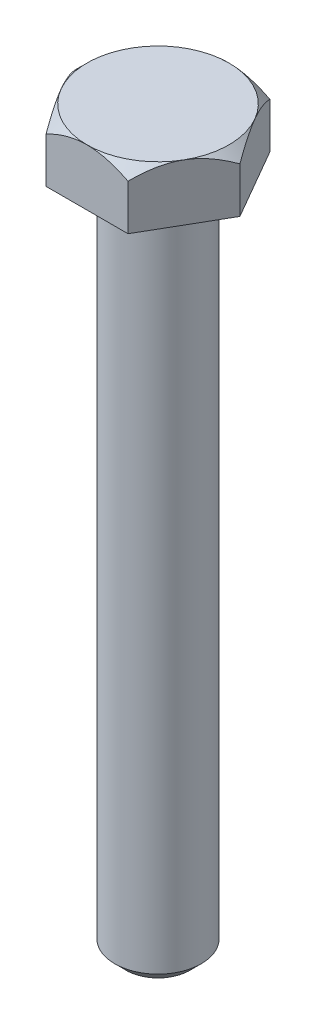
ISO-10303-21;
HEADER;
FILE_DESCRIPTION(('STEP AP214'),'2;1');
FILE_NAME('part.step','',(''),(''),'','','');
FILE_SCHEMA(('AUTOMOTIVE_DESIGN { 1 0 10303 214 1 1 1 1 }'));
ENDSEC;
DATA;
#1=APPLICATION_CONTEXT('core data for automotive mechanical design processes');
#2=APPLICATION_PROTOCOL_DEFINITION('international standard','automotive_design',2000,#1);
#3=PRODUCT_CONTEXT('',#1,'mechanical');
#4=PRODUCT('Part','Part','',(#3));
#5=PRODUCT_RELATED_PRODUCT_CATEGORY('part','',(#4));
#6=PRODUCT_DEFINITION_FORMATION('','',#4);
#7=PRODUCT_DEFINITION_CONTEXT('part definition',#1,'design');
#8=PRODUCT_DEFINITION('design','',#6,#7);
#9=PRODUCT_DEFINITION_SHAPE('','',#8);
#10=(LENGTH_UNIT() NAMED_UNIT(*) SI_UNIT(.MILLI.,.METRE.));
#11=(NAMED_UNIT(*) PLANE_ANGLE_UNIT() SI_UNIT($,.RADIAN.));
#12=(NAMED_UNIT(*) SI_UNIT($,.STERADIAN.) SOLID_ANGLE_UNIT());
#13=UNCERTAINTY_MEASURE_WITH_UNIT(LENGTH_MEASURE(1.E-05),#10,'distance_accuracy_value','');
#14=(GEOMETRIC_REPRESENTATION_CONTEXT(3) GLOBAL_UNCERTAINTY_ASSIGNED_CONTEXT((#13)) GLOBAL_UNIT_ASSIGNED_CONTEXT((#10,
#11,#12)) REPRESENTATION_CONTEXT('',''));
#15=CARTESIAN_POINT('',(0.,0.,0.));
#16=DIRECTION('',(0.,0.,1.));
#17=DIRECTION('',(1.,0.,0.));
#18=AXIS2_PLACEMENT_3D('',#15,#16,#17);
#19=CARTESIAN_POINT('',(3.62500000000007,5.,6.27868417743714));
#20=DIRECTION('',(-0.866025403784442,0.,-0.499999999999995));
#21=DIRECTION('',(-0.499999999999995,0.,0.866025403784442));
#22=AXIS2_PLACEMENT_3D('',#19,#20,#21);
#23=PLANE('',#22);
#24=CARTESIAN_POINT('',(3.62488452994624,4.02856870462476,6.27888417743714));
#25=CARTESIAN_POINT('',(3.68721389664161,4.0908916934917,6.17092654751716));
#26=CARTESIAN_POINT('',(3.75002235616352,4.15130208102734,6.06213910448007));
#27=CARTESIAN_POINT('',(3.87669145105401,4.2677158493395,5.84274179638098));
#28=CARTESIAN_POINT('',(3.94055263837515,4.32371682320785,5.73213097530909));
#29=CARTESIAN_POINT('',(4.13444955410337,4.48471046563524,5.39629166583691));
#30=CARTESIAN_POINT('',(4.26612670995196,4.58200705628878,5.16822014171098));
#31=CARTESIAN_POINT('',(4.53166422082633,4.74862075095615,4.70829568156119));
#32=CARTESIAN_POINT('',(4.66545670737727,4.81835760873348,4.47656029718399));
#33=CARTESIAN_POINT('',(4.86834501872006,4.89902600771869,4.12514743367641));
#34=CARTESIAN_POINT('',(4.93627316062514,4.92191520494596,4.00749244063306));
#35=CARTESIAN_POINT('',(5.07270459498125,4.95919667933445,3.77118626457879));
#36=CARTESIAN_POINT('',(5.14120779992591,4.97359022631844,3.65253523313333));
#37=CARTESIAN_POINT('',(5.30814078917526,4.99772308228725,3.3633988142941));
#38=CARTESIAN_POINT('',(5.40675043702598,5.0027866000747,3.19260189410018));
#39=CARTESIAN_POINT('',(5.60379200256286,4.99428769024785,2.85131589138739));
#40=CARTESIAN_POINT('',(5.70222384583931,4.98071873353769,2.68082693774991));
#41=CARTESIAN_POINT('',(5.89815953180448,4.9357547130673,2.34145637464237));
#42=CARTESIAN_POINT('',(5.99566221252046,4.9043397144273,2.17257677776813));
#43=CARTESIAN_POINT('',(6.18899174051392,4.82539152715257,1.83772021268014));
#44=CARTESIAN_POINT('',(6.28481871570106,4.77785957445157,1.67174302292037));
#45=CARTESIAN_POINT('',(6.45492849942725,4.68007191376467,1.37710423464204));
#46=CARTESIAN_POINT('',(6.52958798795453,4.63238802285783,1.2477902072457));
#47=CARTESIAN_POINT('',(6.67756674436656,4.52933616008443,0.991483482699198));
#48=CARTESIAN_POINT('',(6.75088597153632,4.47396795521828,0.864490856069481));
#49=CARTESIAN_POINT('',(6.89595327454856,4.35678861091045,0.613226916735296));
#50=CARTESIAN_POINT('',(6.96770547617939,4.29499773307909,0.488948457955774));
#51=CARTESIAN_POINT('',(7.10988123305974,4.16578428211806,0.24269282343444));
#52=CARTESIAN_POINT('',(7.18030557110013,4.09836516278837,0.120714291859081));
#53=CARTESIAN_POINT('',(7.25011547005384,4.02856870462477,-0.000200000000000499));
#54=B_SPLINE_CURVE_WITH_KNOTS('',3,(#24,#25,#26,#27,#28,#29,#30,#31,#32,#33,#34,#35,#36,#37,#38,
#39,#40,#41,#42,#43,#44,#45,#46,#47,#48,#49,#50,#51,#52,#53),.UNSPECIFIED.,.F.,.F.,(4,2,2,2,2,2,
2,2,2,2,2,2,2,2,4),(0.,0.418085081925561,0.83639681869771,1.67753646991016,2.50531966073267,
2.91839943514191,3.33141745194524,3.9223507147329,4.51349110216463,5.10529312372582,
5.69704977302065,6.16707290687592,6.63711029563191,7.10570744431351,7.57401912040438),.UNSPECIFIED.);
#55=CARTESIAN_POINT('',(3.62500000000007,4.02868417743718,6.27868417743714));
#56=VERTEX_POINT('',#55);
#57=CARTESIAN_POINT('',(5.43750000000002,5.,3.13934208871856));
#58=VERTEX_POINT('',#57);
#59=EDGE_CURVE('E110',#56,#58,#54,.T.);
#60=ORIENTED_EDGE('',*,*,#59,.F.);
#61=DIRECTION('',(0.,-1.,0.));
#62=VECTOR('',#61,1.);
#63=CARTESIAN_POINT('',(3.62500000000007,5.,6.27868417743714));
#64=LINE('',#63,#62);
#65=CARTESIAN_POINT('',(3.62500000000007,0.,6.27868417743714));
#66=VERTEX_POINT('',#65);
#67=EDGE_CURVE('E59',#56,#66,#64,.T.);
#68=ORIENTED_EDGE('',*,*,#67,.T.);
#69=DIRECTION('',(0.499999999999995,0.,-0.866025403784442));
#70=VECTOR('',#69,1.);
#71=CARTESIAN_POINT('',(3.62500000000007,0.,6.27868417743714));
#72=LINE('',#71,#70);
#73=CARTESIAN_POINT('',(7.25,0.,0.));
#74=VERTEX_POINT('',#73);
#75=EDGE_CURVE('E117',#66,#74,#72,.T.);
#76=ORIENTED_EDGE('',*,*,#75,.T.);
#77=DIRECTION('',(0.,-1.,0.));
#78=VECTOR('',#77,1.);
#79=CARTESIAN_POINT('',(7.25,5.,0.));
#80=LINE('',#79,#78);
#81=CARTESIAN_POINT('',(7.25,4.02868417743718,0.));
#82=VERTEX_POINT('',#81);
#83=EDGE_CURVE('E135',#82,#74,#80,.T.);
#84=ORIENTED_EDGE('',*,*,#83,.F.);
#85=EDGE_CURVE('E118',#58,#82,#54,.T.);
#86=ORIENTED_EDGE('',*,*,#85,.F.);
#87=EDGE_LOOP('',(#60,#68,#76,#84,#86));
#88=FACE_BOUND('',#87,.T.);
#89=ADVANCED_FACE('F36',(#88),#23,.F.);
#90=CARTESIAN_POINT('',(7.25,5.,0.));
#91=DIRECTION('',(-0.866025403784438,0.,0.500000000000001));
#92=DIRECTION('',(0.500000000000001,0.,0.866025403784438));
#93=AXIS2_PLACEMENT_3D('',#90,#91,#92);
#94=PLANE('',#93);
#95=CARTESIAN_POINT('',(7.25011547005384,4.02856870462477,0.000200000000000034));
#96=CARTESIAN_POINT('',(7.18778610335847,4.0908916934917,-0.107757629919975));
#97=CARTESIAN_POINT('',(7.12497764383655,4.15130208102734,-0.21654507295707));
#98=CARTESIAN_POINT('',(6.99830854894606,4.2677158493395,-0.435942381056166));
#99=CARTESIAN_POINT('',(6.93444736162492,4.32371682320785,-0.546553202128054));
#100=CARTESIAN_POINT('',(6.7405504458967,4.48471046563526,-0.882392511600232));
#101=CARTESIAN_POINT('',(6.6088732900481,4.58200705628879,-1.11046403572617));
#102=CARTESIAN_POINT('',(6.34333577917372,4.74862075095617,-1.57038849587596));
#103=CARTESIAN_POINT('',(6.20954329262278,4.8183576087335,-1.80212388025316));
#104=CARTESIAN_POINT('',(6.00665498127998,4.89902600771871,-2.15353674376074));
#105=CARTESIAN_POINT('',(5.9387268393749,4.92191520494598,-2.27119173680409));
#106=CARTESIAN_POINT('',(5.80229540501879,4.95919667933447,-2.50749791285837));
#107=CARTESIAN_POINT('',(5.73379220007413,4.97359022631846,-2.62614894430383));
#108=CARTESIAN_POINT('',(5.56685921082478,4.99772308228727,-2.91528536314305));
#109=CARTESIAN_POINT('',(5.46824956297406,5.00278660007473,-3.08608228333698));
#110=CARTESIAN_POINT('',(5.27120799743718,4.99428769024788,-3.42736828604976));
#111=CARTESIAN_POINT('',(5.17277615416072,4.98071873353772,-3.59785723968724));
#112=CARTESIAN_POINT('',(4.97684046819555,4.93575471306732,-3.93722780279478));
#113=CARTESIAN_POINT('',(4.87933778747957,4.90433971442733,-4.10610739966901));
#114=CARTESIAN_POINT('',(4.68600825948611,4.8253915271526,-4.44096396475701));
#115=CARTESIAN_POINT('',(4.59018128429897,4.7778595744516,-4.60694115451677));
#116=CARTESIAN_POINT('',(4.42007150057277,4.68007191376469,-4.9015799427951));
#117=CARTESIAN_POINT('',(4.34541201204549,4.63238802285786,-5.03089397019145));
#118=CARTESIAN_POINT('',(4.19743325563346,4.52933616008445,-5.28720069473796));
#119=CARTESIAN_POINT('',(4.12411402846369,4.4739679552183,-5.41419332136768));
#120=CARTESIAN_POINT('',(3.97904672545145,4.35678861091046,-5.66545726070187));
#121=CARTESIAN_POINT('',(3.90729452382061,4.2949977330791,-5.7897357194814));
#122=CARTESIAN_POINT('',(3.76511876694025,4.16578428211807,-6.03599135400274));
#123=CARTESIAN_POINT('',(3.69469442889986,4.09836516278837,-6.1579698855781));
#124=CARTESIAN_POINT('',(3.62488452994615,4.02856870462476,-6.27888417743719));
#125=B_SPLINE_CURVE_WITH_KNOTS('',3,(#95,#96,#97,#98,#99,#100,#101,#102,#103,#104,#105,#106,
#107,#108,#109,#110,#111,#112,#113,#114,#115,#116,#117,#118,#119,#120,#121,#122,#123,#124),
.UNSPECIFIED.,.F.,.F.,(4,2,2,2,2,2,2,2,2,2,2,2,2,2,4),(0.,0.418085081925567,0.83639681869772,
1.67753646991019,2.5053196607327,2.91839943514195,3.33141745194528,3.92235071473293,
4.51349110216466,5.10529312372585,5.69704977302068,6.16707290687597,6.63711029563198,
7.1057074443136,7.57401912040448),.UNSPECIFIED.);
#126=CARTESIAN_POINT('',(5.43749999999999,5.,-3.13934208871859));
#127=VERTEX_POINT('',#126);
#128=EDGE_CURVE('E125',#82,#127,#125,.T.);
#129=ORIENTED_EDGE('',*,*,#128,.F.);
#130=ORIENTED_EDGE('',*,*,#83,.T.);
#131=DIRECTION('',(-0.500000000000001,0.,-0.866025403784438));
#132=VECTOR('',#131,1.);
#133=CARTESIAN_POINT('',(7.25,0.,0.));
#134=LINE('',#133,#132);
#135=CARTESIAN_POINT('',(3.62499999999999,0.,-6.27868417743719));
#136=VERTEX_POINT('',#135);
#137=EDGE_CURVE('E398',#74,#136,#134,.T.);
#138=ORIENTED_EDGE('',*,*,#137,.T.);
#139=DIRECTION('',(0.,-1.,0.));
#140=VECTOR('',#139,1.);
#141=CARTESIAN_POINT('',(3.62499999999999,5.,-6.27868417743719));
#142=LINE('',#141,#140);
#143=CARTESIAN_POINT('',(3.62499999999999,4.02868417743718,-6.27868417743719));
#144=VERTEX_POINT('',#143);
#145=EDGE_CURVE('E204',#144,#136,#142,.T.);
#146=ORIENTED_EDGE('',*,*,#145,.F.);
#147=EDGE_CURVE('E136',#127,#144,#125,.T.);
#148=ORIENTED_EDGE('',*,*,#147,.F.);
#149=EDGE_LOOP('',(#129,#130,#138,#146,#148));
#150=FACE_BOUND('',#149,.T.);
#151=ADVANCED_FACE('F192',(#150),#94,.F.);
#152=CARTESIAN_POINT('',(3.62499999999999,5.,-6.27868417743719));
#153=DIRECTION('',(0.,0.,1.));
#154=DIRECTION('',(1.,0.,0.));
#155=AXIS2_PLACEMENT_3D('',#152,#153,#154);
#156=PLANE('',#155);
#157=CARTESIAN_POINT('',(-7.57666051860033,1.43857952280487,-6.27868417743715));
#158=CARTESIAN_POINT('',(-7.39365651230783,1.57945688959872,-6.27868417743715));
#159=CARTESIAN_POINT('',(-7.20966776392706,1.71907512434262,-6.27868417743715));
#160=CARTESIAN_POINT('',(-6.83931781583867,1.99521769306877,-6.27868417743715));
#161=CARTESIAN_POINT('',(-6.65295606622731,2.13174128876494,-6.27868417743715));
#162=CARTESIAN_POINT('',(-6.27609540777261,2.40209046760801,-6.27868417743715));
#163=CARTESIAN_POINT('',(-6.08557567548029,2.53588711812094,-6.27868417743715));
#164=CARTESIAN_POINT('',(-5.7013676758548,2.79883528544532,-6.27868417743716));
#165=CARTESIAN_POINT('',(-5.50767962786199,2.92798712185071,-6.27868417743716));
#166=CARTESIAN_POINT('',(-5.10415932230891,3.18862292545138,-6.27868417743716));
#167=CARTESIAN_POINT('',(-4.89408397797518,3.31973242959604,-6.27868417743716));
#168=CARTESIAN_POINT('',(-4.46899924146733,3.57382963916996,-6.27868417743716));
#169=CARTESIAN_POINT('',(-4.25398902548427,3.69681597506302,-6.27868417743716));
#170=CARTESIAN_POINT('',(-3.81897305439861,3.93204888921299,-6.27868417743716));
#171=CARTESIAN_POINT('',(-3.59898447967616,4.04432699068524,-6.27868417743716));
#172=CARTESIAN_POINT('',(-3.15278127156474,4.25562782816849,-6.27868417743717));
#173=CARTESIAN_POINT('',(-2.92656964053751,4.35465682564157,-6.27868417743717));
#174=CARTESIAN_POINT('',(-2.49021164331831,4.52687246842811,-6.27868417743717));
#175=CARTESIAN_POINT('',(-2.28069897147736,4.60164844585029,-6.27868417743717));
#176=CARTESIAN_POINT('',(-1.85632597962451,4.73443118921241,-6.27868417743717));
#177=CARTESIAN_POINT('',(-1.64146532079161,4.79243688972169,-6.27868417743717));
#178=CARTESIAN_POINT('',(-1.21142765694939,4.8875683886695,-6.27868417743717));
#179=CARTESIAN_POINT('',(-0.996336148218653,4.9250741683904,-6.27868417743717));
#180=CARTESIAN_POINT('',(-0.56346815275014,4.97842167925469,-6.27868417743717));
#181=CARTESIAN_POINT('',(-0.345692236177016,4.99426793349426,-6.27868417743717));
#182=CARTESIAN_POINT('',(0.0807362217716663,5.0029407360174,-6.27868417743718));
#183=CARTESIAN_POINT('',(0.289368982497101,4.99674859993676,-6.27868417743718));
#184=CARTESIAN_POINT('',(0.705011615215947,4.96394190845027,-6.27868417743718));
#185=CARTESIAN_POINT('',(0.912021338466265,4.9373255028629,-6.27868417743718));
#186=CARTESIAN_POINT('',(1.3264284221839,4.86472465401487,-6.27868417743718));
#187=CARTESIAN_POINT('',(1.53376477368789,4.81839783409703,-6.27868417743718));
#188=CARTESIAN_POINT('',(1.94386969783723,4.70894974197332,-6.27868417743718));
#189=CARTESIAN_POINT('',(2.14663852486609,4.64582940758558,-6.27868417743718));
#190=CARTESIAN_POINT('',(2.55855272468635,4.5016094654899,-6.27868417743719));
#191=CARTESIAN_POINT('',(2.76740928890636,4.41969434988626,-6.27868417743719));
#192=CARTESIAN_POINT('',(3.17975166734441,4.24320663783212,-6.27868417743719));
#193=CARTESIAN_POINT('',(3.38323501259331,4.14862833983322,-6.27868417743719));
#194=CARTESIAN_POINT('',(3.78579095692702,3.94905699505205,-6.27868417743719));
#195=CARTESIAN_POINT('',(3.98484753290937,3.84403189037483,-6.27868417743719));
#196=CARTESIAN_POINT('',(4.37839993765141,3.62587782327072,-6.27868417743719));
#197=CARTESIAN_POINT('',(4.57289646186356,3.51275010738356,-6.27868417743719));
#198=CARTESIAN_POINT('',(4.94842033299621,3.28571869098054,-6.27868417743719));
#199=CARTESIAN_POINT('',(5.12963857253774,3.17212907012057,-6.27868417743719));
#200=CARTESIAN_POINT('',(5.48896153359933,2.94011331347926,-6.2786841774372));
#201=CARTESIAN_POINT('',(5.66706602033122,2.82168681520702,-6.2786841774372));
#202=CARTESIAN_POINT('',(6.01913728036014,2.5818234603211,-6.2786841774372));
#203=CARTESIAN_POINT('',(6.19312579011556,2.46041839375126,-6.2786841774372));
#204=CARTESIAN_POINT('',(6.5387156854476,2.2143526316317,-6.2786841774372));
#205=CARTESIAN_POINT('',(6.71031771587599,2.08969284280949,-6.2786841774372));
#206=CARTESIAN_POINT('',(6.88091860823282,1.96370076934005,-6.2786841774372));
#207=B_SPLINE_CURVE_WITH_KNOTS('',3,(#157,#158,#159,#160,#161,#162,#163,#164,#165,#166,#167,
#168,#169,#170,#171,#172,#173,#174,#175,#176,#177,#178,#179,#180,#181,#182,#183,#184,#185,#186,
#187,#188,#189,#190,#191,#192,#193,#194,#195,#196,#197,#198,#199,#200,#201,#202,#203,#204,#205,
#206),.UNSPECIFIED.,.F.,.F.,(4,2,2,2,2,2,2,2,2,2,2,2,2,2,2,2,2,2,2,2,2,2,2,2,4),(0.,
0.692856158772512,1.38587590819399,2.0842410666755,2.78255808072084,3.52530650890354,
4.26817984375935,5.00879403011467,5.74905696003691,6.41585238613356,7.08269016503529,
7.73670784074358,8.39058891895184,9.01572562815278,9.64091897355062,10.2774464921539,
10.9139384719306,11.586461232698,12.2592878189047,12.9342468231889,13.6091022110665,
14.2506381722582,14.8922223007264,15.5286570401769,16.1649163294069),.UNSPECIFIED.);
#208=CARTESIAN_POINT('',(0.,5.,-6.27868417743718));
#209=VERTEX_POINT('',#208);
#210=EDGE_CURVE('E186',#144,#209,#207,.F.);
#211=ORIENTED_EDGE('',*,*,#210,.F.);
#212=ORIENTED_EDGE('',*,*,#145,.T.);
#213=DIRECTION('',(-1.,0.,0.));
#214=VECTOR('',#213,1.);
#215=CARTESIAN_POINT('',(3.62499999999999,0.,-6.27868417743719));
#216=LINE('',#215,#214);
#217=CARTESIAN_POINT('',(-3.62500000000003,0.,-6.27868417743716));
#218=VERTEX_POINT('',#217);
#219=EDGE_CURVE('E222',#136,#218,#216,.T.);
#220=ORIENTED_EDGE('',*,*,#219,.T.);
#221=DIRECTION('',(0.,-1.,0.));
#222=VECTOR('',#221,1.);
#223=CARTESIAN_POINT('',(-3.62500000000003,5.,-6.27868417743716));
#224=LINE('',#223,#222);
#225=CARTESIAN_POINT('',(-3.62500000000003,4.02868417743718,-6.27868417743716));
#226=VERTEX_POINT('',#225);
#227=EDGE_CURVE('E220',#226,#218,#224,.T.);
#228=ORIENTED_EDGE('',*,*,#227,.F.);
#229=EDGE_CURVE('E181',#209,#226,#207,.F.);
#230=ORIENTED_EDGE('',*,*,#229,.F.);
#231=EDGE_LOOP('',(#211,#212,#220,#228,#230));
#232=FACE_BOUND('',#231,.T.);
#233=ADVANCED_FACE('F188',(#232),#156,.F.);
#234=CARTESIAN_POINT('',(-3.62500000000003,5.,-6.27868417743716));
#235=DIRECTION('',(0.866025403784442,0.,0.499999999999995));
#236=DIRECTION('',(0.499999999999995,0.,-0.866025403784442));
#237=AXIS2_PLACEMENT_3D('',#234,#235,#236);
#238=PLANE('',#237);
#239=CARTESIAN_POINT('',(-3.62488452994619,4.02856870462477,-6.27888417743716));
#240=CARTESIAN_POINT('',(-3.68721389664156,4.0908916934917,-6.17092654751719));
#241=CARTESIAN_POINT('',(-3.75002235616348,4.15130208102734,-6.06213910448009));
#242=CARTESIAN_POINT('',(-3.87669145105397,4.2677158493395,-5.842741796381));
#243=CARTESIAN_POINT('',(-3.94055263837511,4.32371682320785,-5.73213097530911));
#244=CARTESIAN_POINT('',(-4.13444955410333,4.48471046563526,-5.39629166583693));
#245=CARTESIAN_POINT('',(-4.26612670995192,4.58200705628879,-5.16822014171099));
#246=CARTESIAN_POINT('',(-4.5316642208263,4.74862075095617,-4.7082956815612));
#247=CARTESIAN_POINT('',(-4.66545670737723,4.8183576087335,-4.476560297184));
#248=CARTESIAN_POINT('',(-4.86834501872003,4.89902600771871,-4.12514743367642));
#249=CARTESIAN_POINT('',(-4.93627316062511,4.92191520494598,-4.00749244063306));
#250=CARTESIAN_POINT('',(-5.07270459498122,4.95919667933447,-3.77118626457879));
#251=CARTESIAN_POINT('',(-5.14120779992588,4.97359022631847,-3.65253523313333));
#252=CARTESIAN_POINT('',(-5.30814078917523,4.99772308228727,-3.3633988142941));
#253=CARTESIAN_POINT('',(-5.40675043702595,5.00278660007473,-3.19260189410018));
#254=CARTESIAN_POINT('',(-5.60379200256283,4.99428769024788,-2.85131589138739));
#255=CARTESIAN_POINT('',(-5.70222384583928,4.98071873353772,-2.68082693774991));
#256=CARTESIAN_POINT('',(-5.89815953180445,4.93575471306732,-2.34145637464237));
#257=CARTESIAN_POINT('',(-5.99566221252043,4.90433971442733,-2.17257677776813));
#258=CARTESIAN_POINT('',(-6.18899174051389,4.8253915271526,-1.83772021268014));
#259=CARTESIAN_POINT('',(-6.28481871570103,4.7778595744516,-1.67174302292038));
#260=CARTESIAN_POINT('',(-6.45492849942722,4.68007191376469,-1.37710423464204));
#261=CARTESIAN_POINT('',(-6.5295879879545,4.63238802285786,-1.24779020724569));
#262=CARTESIAN_POINT('',(-6.67756674436654,4.52933616008446,-0.991483482699183));
#263=CARTESIAN_POINT('',(-6.7508859715363,4.4739679552183,-0.864490856069462));
#264=CARTESIAN_POINT('',(-6.89595327454855,4.35678861091046,-0.613226916735267));
#265=CARTESIAN_POINT('',(-6.96770547617938,4.2949977330791,-0.488948457955741));
#266=CARTESIAN_POINT('',(-7.10988123305973,4.16578428211807,-0.242692823434398));
#267=CARTESIAN_POINT('',(-7.18030557110012,4.09836516278837,-0.120714291859035));
#268=CARTESIAN_POINT('',(-7.25011547005384,4.02856870462476,0.000200000000050344));
#269=B_SPLINE_CURVE_WITH_KNOTS('',3,(#239,#240,#241,#242,#243,#244,#245,#246,#247,#248,#249,
#250,#251,#252,#253,#254,#255,#256,#257,#258,#259,#260,#261,#262,#263,#264,#265,#266,#267,#268),
.UNSPECIFIED.,.F.,.F.,(4,2,2,2,2,2,2,2,2,2,2,2,2,2,4),(0.,0.418085081925566,0.836396818697719,
1.67753646991018,2.5053196607327,2.91839943514195,3.33141745194527,3.92235071473293,
4.51349110216466,5.10529312372584,5.69704977302067,6.16707290687597,6.63711029563198,
7.1057074443136,7.57401912040448),.UNSPECIFIED.);
#270=CARTESIAN_POINT('',(-5.43750000000001,5.,-3.13934208871856));
#271=VERTEX_POINT('',#270);
#272=EDGE_CURVE('E187',#226,#271,#269,.T.);
#273=ORIENTED_EDGE('',*,*,#272,.F.);
#274=ORIENTED_EDGE('',*,*,#227,.T.);
#275=DIRECTION('',(-0.499999999999995,0.,0.866025403784441));
#276=VECTOR('',#275,1.);
#277=CARTESIAN_POINT('',(-3.62500000000003,0.,-6.27868417743716));
#278=LINE('',#277,#276);
#279=CARTESIAN_POINT('',(-7.25,0.,0.));
#280=VERTEX_POINT('',#279);
#281=EDGE_CURVE('E396',#218,#280,#278,.T.);
#282=ORIENTED_EDGE('',*,*,#281,.T.);
#283=DIRECTION('',(0.,-1.,0.));
#284=VECTOR('',#283,1.);
#285=CARTESIAN_POINT('',(-7.25,5.,0.));
#286=LINE('',#285,#284);
#287=CARTESIAN_POINT('',(-7.25,4.02868417743718,0.));
#288=VERTEX_POINT('',#287);
#289=EDGE_CURVE('E226',#288,#280,#286,.T.);
#290=ORIENTED_EDGE('',*,*,#289,.F.);
#291=EDGE_CURVE('E176',#271,#288,#269,.T.);
#292=ORIENTED_EDGE('',*,*,#291,.F.);
#293=EDGE_LOOP('',(#273,#274,#282,#290,#292));
#294=FACE_BOUND('',#293,.T.);
#295=ADVANCED_FACE('F191',(#294),#238,.F.);
#296=CARTESIAN_POINT('',(-7.25,5.,0.));
#297=DIRECTION('',(0.866025403784435,0.,-0.500000000000007));
#298=DIRECTION('',(-0.500000000000007,0.,-0.866025403784435));
#299=AXIS2_PLACEMENT_3D('',#296,#297,#298);
#300=PLANE('',#299);
#301=CARTESIAN_POINT('',(-7.25011547005384,4.02856870462477,-0.000199999999949406));
#302=CARTESIAN_POINT('',(-7.18778610335847,4.0908916934917,0.107757629920025));
#303=CARTESIAN_POINT('',(-7.12497764383655,4.15130208102734,0.216545072957119));
#304=CARTESIAN_POINT('',(-6.99830854894605,4.2677158493395,0.435942381056215));
#305=CARTESIAN_POINT('',(-6.93444736162491,4.32371682320785,0.546553202128102));
#306=CARTESIAN_POINT('',(-6.74055044589669,4.48471046563525,0.882392511600279));
#307=CARTESIAN_POINT('',(-6.60887329004809,4.58200705628879,1.11046403572621));
#308=CARTESIAN_POINT('',(-6.34333577917371,4.74862075095617,1.570388495876));
#309=CARTESIAN_POINT('',(-6.20954329262277,4.8183576087335,1.8021238802532));
#310=CARTESIAN_POINT('',(-6.00665498127997,4.89902600771871,2.15353674376078));
#311=CARTESIAN_POINT('',(-5.93872683937489,4.92191520494598,2.27119173680413));
#312=CARTESIAN_POINT('',(-5.80229540501878,4.95919667933447,2.50749791285841));
#313=CARTESIAN_POINT('',(-5.73379220007411,4.97359022631847,2.62614894430387));
#314=CARTESIAN_POINT('',(-5.56685921082476,4.99772308228727,2.91528536314309));
#315=CARTESIAN_POINT('',(-5.46824956297404,5.00278660007473,3.08608228333701));
#316=CARTESIAN_POINT('',(-5.27120799743715,4.99428769024788,3.4273682860498));
#317=CARTESIAN_POINT('',(-5.1727761541607,4.98071873353772,3.59785723968728));
#318=CARTESIAN_POINT('',(-4.97684046819552,4.93575471306732,3.93722780279481));
#319=CARTESIAN_POINT('',(-4.87933778747955,4.90433971442733,4.10610739966905));
#320=CARTESIAN_POINT('',(-4.68600825948608,4.8253915271526,4.44096396475704));
#321=CARTESIAN_POINT('',(-4.59018128429894,4.7778595744516,4.6069411545168));
#322=CARTESIAN_POINT('',(-4.42007150057274,4.68007191376469,4.90157994279513));
#323=CARTESIAN_POINT('',(-4.34541201204546,4.63238802285786,5.03089397019148));
#324=CARTESIAN_POINT('',(-4.19743325563342,4.52933616008446,5.28720069473799));
#325=CARTESIAN_POINT('',(-4.12411402846365,4.4739679552183,5.41419332136771));
#326=CARTESIAN_POINT('',(-3.9790467254514,4.35678861091047,5.6654572607019));
#327=CARTESIAN_POINT('',(-3.90729452382057,4.2949977330791,5.78973571948143));
#328=CARTESIAN_POINT('',(-3.76511876694021,4.16578428211807,6.03599135400277));
#329=CARTESIAN_POINT('',(-3.69469442889982,4.09836516278837,6.15796988557813));
#330=CARTESIAN_POINT('',(-3.6248845299461,4.02856870462477,6.27888417743721));
#331=B_SPLINE_CURVE_WITH_KNOTS('',3,(#301,#302,#303,#304,#305,#306,#307,#308,#309,#310,#311,
#312,#313,#314,#315,#316,#317,#318,#319,#320,#321,#322,#323,#324,#325,#326,#327,#328,#329,#330),
.UNSPECIFIED.,.F.,.F.,(4,2,2,2,2,2,2,2,2,2,2,2,2,2,4),(0.,0.418085081925566,0.836396818697719,
1.67753646991019,2.50531966073269,2.91839943514195,3.33141745194527,3.92235071473293,
4.51349110216466,5.10529312372585,5.69704977302068,6.16707290687597,6.63711029563198,
7.1057074443136,7.57401912040449),.UNSPECIFIED.);
#332=CARTESIAN_POINT('',(-5.43749999999997,5.,3.13934208871863));
#333=VERTEX_POINT('',#332);
#334=EDGE_CURVE('E381',#288,#333,#331,.T.);
#335=ORIENTED_EDGE('',*,*,#334,.F.);
#336=ORIENTED_EDGE('',*,*,#289,.T.);
#337=DIRECTION('',(0.500000000000007,0.,0.866025403784434));
#338=VECTOR('',#337,1.);
#339=CARTESIAN_POINT('',(-7.25,0.,0.));
#340=LINE('',#339,#338);
#341=CARTESIAN_POINT('',(-3.62499999999994,0.,6.27868417743721));
#342=VERTEX_POINT('',#341);
#343=EDGE_CURVE('E389',#280,#342,#340,.T.);
#344=ORIENTED_EDGE('',*,*,#343,.T.);
#345=DIRECTION('',(0.,-1.,0.));
#346=VECTOR('',#345,1.);
#347=CARTESIAN_POINT('',(-3.62499999999994,5.,6.27868417743721));
#348=LINE('',#347,#346);
#349=CARTESIAN_POINT('',(-3.62499999999994,4.02868417743718,6.27868417743721));
#350=VERTEX_POINT('',#349);
#351=EDGE_CURVE('E229',#350,#342,#348,.T.);
#352=ORIENTED_EDGE('',*,*,#351,.F.);
#353=EDGE_CURVE('E169',#333,#350,#331,.T.);
#354=ORIENTED_EDGE('',*,*,#353,.F.);
#355=EDGE_LOOP('',(#335,#336,#344,#352,#354));
#356=FACE_BOUND('',#355,.T.);
#357=ADVANCED_FACE('F309',(#356),#300,.F.);
#358=CARTESIAN_POINT('',(-3.62499999999994,5.,6.27868417743721));
#359=DIRECTION('',(0.,0.,-1.));
#360=DIRECTION('',(-1.,0.,0.));
#361=AXIS2_PLACEMENT_3D('',#358,#359,#360);
#362=PLANE('',#361);
#363=CARTESIAN_POINT('',(-7.57666051860024,1.43857952280487,6.27868417743725));
#364=CARTESIAN_POINT('',(-7.39365651230774,1.57945688959872,6.27868417743725));
#365=CARTESIAN_POINT('',(-7.20966776392697,1.71907512434262,6.27868417743725));
#366=CARTESIAN_POINT('',(-6.83931781583858,1.99521769306878,6.27868417743725));
#367=CARTESIAN_POINT('',(-6.65295606622722,2.13174128876494,6.27868417743725));
#368=CARTESIAN_POINT('',(-6.27609540777252,2.40209046760801,6.27868417743724));
#369=CARTESIAN_POINT('',(-6.0855756754802,2.53588711812094,6.27868417743724));
#370=CARTESIAN_POINT('',(-5.70136767585471,2.79883528544532,6.27868417743724));
#371=CARTESIAN_POINT('',(-5.50767962786191,2.92798712185071,6.27868417743723));
#372=CARTESIAN_POINT('',(-5.10415932230883,3.18862292545138,6.27868417743723));
#373=CARTESIAN_POINT('',(-4.89408397797509,3.31973242959604,6.27868417743723));
#374=CARTESIAN_POINT('',(-4.46899924146725,3.57382963916996,6.27868417743722));
#375=CARTESIAN_POINT('',(-4.25398902548418,3.69681597506302,6.27868417743722));
#376=CARTESIAN_POINT('',(-3.81897305439853,3.93204888921299,6.27868417743722));
#377=CARTESIAN_POINT('',(-3.59898447967608,4.04432699068524,6.27868417743721));
#378=CARTESIAN_POINT('',(-3.15278127156466,4.25562782816848,6.27868417743721));
#379=CARTESIAN_POINT('',(-2.92656964053743,4.35465682564157,6.27868417743721));
#380=CARTESIAN_POINT('',(-2.49021164331822,4.52687246842811,6.2786841774372));
#381=CARTESIAN_POINT('',(-2.28069897147728,4.60164844585029,6.2786841774372));
#382=CARTESIAN_POINT('',(-1.85632597962443,4.73443118921241,6.2786841774372));
#383=CARTESIAN_POINT('',(-1.64146532079152,4.79243688972169,6.27868417743719));
#384=CARTESIAN_POINT('',(-1.2114276569493,4.8875683886695,6.27868417743719));
#385=CARTESIAN_POINT('',(-0.996336148218567,4.9250741683904,6.27868417743719));
#386=CARTESIAN_POINT('',(-0.563468152750053,4.97842167925468,6.27868417743718));
#387=CARTESIAN_POINT('',(-0.345692236176929,4.99426793349426,6.27868417743718));
#388=CARTESIAN_POINT('',(0.0807362217717539,5.00294073601741,6.27868417743718));
#389=CARTESIAN_POINT('',(0.289368982497189,4.99674859993676,6.27868417743717));
#390=CARTESIAN_POINT('',(0.705011615216036,4.96394190845027,6.27868417743717));
#391=CARTESIAN_POINT('',(0.912021338466354,4.9373255028629,6.27868417743717));
#392=CARTESIAN_POINT('',(1.32642842218399,4.86472465401487,6.27868417743716));
#393=CARTESIAN_POINT('',(1.53376477368798,4.81839783409703,6.27868417743716));
#394=CARTESIAN_POINT('',(1.94386969783732,4.70894974197332,6.27868417743716));
#395=CARTESIAN_POINT('',(2.14663852486618,4.64582940758559,6.27868417743715));
#396=CARTESIAN_POINT('',(2.55855272468644,4.5016094654899,6.27868417743715));
#397=CARTESIAN_POINT('',(2.76740928890645,4.41969434988626,6.27868417743715));
#398=CARTESIAN_POINT('',(3.1797516673445,4.24320663783212,6.27868417743714));
#399=CARTESIAN_POINT('',(3.3832350125934,4.14862833983321,6.27868417743714));
#400=CARTESIAN_POINT('',(3.78579095692711,3.94905699505205,6.27868417743714));
#401=CARTESIAN_POINT('',(3.98484753290946,3.84403189037483,6.27868417743714));
#402=CARTESIAN_POINT('',(4.3783999376515,3.62587782327071,6.27868417743713));
#403=CARTESIAN_POINT('',(4.57289646186365,3.51275010738355,6.27868417743713));
#404=CARTESIAN_POINT('',(4.9484203329963,3.28571869098054,6.27868417743713));
#405=CARTESIAN_POINT('',(5.12963857253784,3.17212907012056,6.27868417743712));
#406=CARTESIAN_POINT('',(5.48896153359942,2.94011331347926,6.27868417743712));
#407=CARTESIAN_POINT('',(5.66706602033131,2.82168681520701,6.27868417743712));
#408=CARTESIAN_POINT('',(6.01913728036024,2.58182346032109,6.27868417743711));
#409=CARTESIAN_POINT('',(6.19312579011566,2.46041839375125,6.27868417743711));
#410=CARTESIAN_POINT('',(6.5387156854477,2.21435263163169,6.27868417743711));
#411=CARTESIAN_POINT('',(6.71031771587608,2.08969284280948,6.27868417743711));
#412=CARTESIAN_POINT('',(6.88091860823291,1.96370076934005,6.27868417743711));
#413=B_SPLINE_CURVE_WITH_KNOTS('',3,(#363,#364,#365,#366,#367,#368,#369,#370,#371,#372,#373,
#374,#375,#376,#377,#378,#379,#380,#381,#382,#383,#384,#385,#386,#387,#388,#389,#390,#391,#392,
#393,#394,#395,#396,#397,#398,#399,#400,#401,#402,#403,#404,#405,#406,#407,#408,#409,#410,#411,
#412),.UNSPECIFIED.,.F.,.F.,(4,2,2,2,2,2,2,2,2,2,2,2,2,2,2,2,2,2,2,2,2,2,2,2,4),(0.,
0.692856158772512,1.38587590819398,2.0842410666755,2.78255808072084,3.52530650890354,
4.26817984375935,5.00879403011467,5.7490569600369,6.41585238613355,7.08269016503529,
7.73670784074358,8.39058891895183,9.01572562815278,9.64091897355062,10.2774464921539,
10.9139384719306,11.586461232698,12.2592878189047,12.9342468231889,13.6091022110665,
14.2506381722582,14.8922223007265,15.5286570401769,16.1649163294069),.UNSPECIFIED.);
#414=CARTESIAN_POINT('',(0.,5.,6.27868417743717));
#415=VERTEX_POINT('',#414);
#416=EDGE_CURVE('E383',#350,#415,#413,.T.);
#417=ORIENTED_EDGE('',*,*,#416,.F.);
#418=ORIENTED_EDGE('',*,*,#351,.T.);
#419=DIRECTION('',(1.,0.,0.));
#420=VECTOR('',#419,1.);
#421=CARTESIAN_POINT('',(-3.62499999999994,0.,6.27868417743721));
#422=LINE('',#421,#420);
#423=EDGE_CURVE('E391',#342,#66,#422,.T.);
#424=ORIENTED_EDGE('',*,*,#423,.T.);
#425=ORIENTED_EDGE('',*,*,#67,.F.);
#426=EDGE_CURVE('E115',#415,#56,#413,.T.);
#427=ORIENTED_EDGE('',*,*,#426,.F.);
#428=EDGE_LOOP('',(#417,#418,#424,#425,#427));
#429=FACE_BOUND('',#428,.T.);
#430=ADVANCED_FACE('F302',(#429),#362,.F.);
#431=CARTESIAN_POINT('',(0.,0.,0.));
#432=DIRECTION('',(0.,1.,0.));
#433=DIRECTION('',(0.,0.,1.));
#434=AXIS2_PLACEMENT_3D('',#431,#432,#433);
#435=PLANE('',#434);
#436=CARTESIAN_POINT('',(0.,0.,0.));
#437=DIRECTION('',(0.,1.,0.));
#438=DIRECTION('',(0.,0.,1.));
#439=AXIS2_PLACEMENT_3D('',#436,#437,#438);
#440=CIRCLE('',#439,4.825);
#441=CARTESIAN_POINT('',(0.,0.,4.825));
#442=VERTEX_POINT('',#441);
#443=EDGE_CURVE('E236',#442,#442,#440,.T.);
#444=ORIENTED_EDGE('',*,*,#443,.T.);
#445=EDGE_LOOP('',(#444));
#446=FACE_BOUND('',#445,.T.);
#447=ORIENTED_EDGE('',*,*,#75,.F.);
#448=ORIENTED_EDGE('',*,*,#423,.F.);
#449=ORIENTED_EDGE('',*,*,#343,.F.);
#450=ORIENTED_EDGE('',*,*,#281,.F.);
#451=ORIENTED_EDGE('',*,*,#219,.F.);
#452=ORIENTED_EDGE('',*,*,#137,.F.);
#453=EDGE_LOOP('',(#447,#448,#449,#450,#451,#452));
#454=FACE_BOUND('',#453,.T.);
#455=ADVANCED_FACE('F295',(#446,#454),#435,.F.);
#456=CARTESIAN_POINT('',(0.,5.,0.));
#457=DIRECTION('',(0.,-1.,0.));
#458=DIRECTION('',(0.,0.,1.));
#459=AXIS2_PLACEMENT_3D('',#456,#457,#458);
#460=CONICAL_SURFACE('',#459,6.27868417743718,0.78539816339745);
#461=ORIENTED_EDGE('',*,*,#353,.T.);
#462=ORIENTED_EDGE('',*,*,#416,.T.);
#463=CARTESIAN_POINT('',(0.,5.,0.));
#464=DIRECTION('',(0.,1.,0.));
#465=DIRECTION('',(0.,0.,1.));
#466=AXIS2_PLACEMENT_3D('',#463,#464,#465);
#467=CIRCLE('',#466,6.27868417743718);
#468=EDGE_CURVE('E51',#333,#415,#467,.T.);
#469=ORIENTED_EDGE('',*,*,#468,.F.);
#470=EDGE_LOOP('',(#461,#462,#469));
#471=FACE_BOUND('',#470,.T.);
#472=ADVANCED_FACE('F155',(#471),#460,.T.);
#473=ORIENTED_EDGE('',*,*,#291,.T.);
#474=ORIENTED_EDGE('',*,*,#334,.T.);
#475=EDGE_CURVE('E217',#271,#333,#467,.T.);
#476=ORIENTED_EDGE('',*,*,#475,.F.);
#477=EDGE_LOOP('',(#473,#474,#476));
#478=FACE_BOUND('',#477,.T.);
#479=ADVANCED_FACE('F283',(#478),#460,.T.);
#480=ORIENTED_EDGE('',*,*,#229,.T.);
#481=ORIENTED_EDGE('',*,*,#272,.T.);
#482=EDGE_CURVE('E212',#209,#271,#467,.T.);
#483=ORIENTED_EDGE('',*,*,#482,.F.);
#484=EDGE_LOOP('',(#480,#481,#483));
#485=FACE_BOUND('',#484,.T.);
#486=ADVANCED_FACE('F213',(#485),#460,.T.);
#487=ORIENTED_EDGE('',*,*,#147,.T.);
#488=ORIENTED_EDGE('',*,*,#210,.T.);
#489=EDGE_CURVE('E130',#127,#209,#467,.T.);
#490=ORIENTED_EDGE('',*,*,#489,.F.);
#491=EDGE_LOOP('',(#487,#488,#490));
#492=FACE_BOUND('',#491,.T.);
#493=ADVANCED_FACE('F208',(#492),#460,.T.);
#494=ORIENTED_EDGE('',*,*,#85,.T.);
#495=ORIENTED_EDGE('',*,*,#128,.T.);
#496=EDGE_CURVE('E122',#58,#127,#467,.T.);
#497=ORIENTED_EDGE('',*,*,#496,.F.);
#498=EDGE_LOOP('',(#494,#495,#497));
#499=FACE_BOUND('',#498,.T.);
#500=ADVANCED_FACE('F123',(#499),#460,.T.);
#501=ORIENTED_EDGE('',*,*,#59,.T.);
#502=CARTESIAN_POINT('',(0.,5.,0.));
#503=DIRECTION('',(0.,1.,0.));
#504=DIRECTION('',(0.,0.,1.));
#505=AXIS2_PLACEMENT_3D('',#502,#503,#504);
#506=CIRCLE('',#505,6.27868417743718);
#507=EDGE_CURVE('E113',#415,#58,#506,.T.);
#508=ORIENTED_EDGE('',*,*,#507,.F.);
#509=ORIENTED_EDGE('',*,*,#426,.T.);
#510=EDGE_LOOP('',(#501,#508,#509));
#511=FACE_BOUND('',#510,.T.);
#512=ADVANCED_FACE('F112',(#511),#460,.T.);
#513=CARTESIAN_POINT('',(0.,5.,0.));
#514=DIRECTION('',(0.,1.,0.));
#515=DIRECTION('',(0.,0.,1.));
#516=AXIS2_PLACEMENT_3D('',#513,#514,#515);
#517=PLANE('',#516);
#518=ORIENTED_EDGE('',*,*,#468,.T.);
#519=ORIENTED_EDGE('',*,*,#507,.T.);
#520=ORIENTED_EDGE('',*,*,#496,.T.);
#521=ORIENTED_EDGE('',*,*,#489,.T.);
#522=ORIENTED_EDGE('',*,*,#482,.T.);
#523=ORIENTED_EDGE('',*,*,#475,.T.);
#524=EDGE_LOOP('',(#518,#519,#520,#521,#522,#523));
#525=FACE_BOUND('',#524,.T.);
#526=ADVANCED_FACE('F132',(#525),#517,.T.);
#527=CARTESIAN_POINT('',(0.,-60.,0.));
#528=DIRECTION('',(0.,1.,0.));
#529=DIRECTION('',(0.,0.,1.));
#530=AXIS2_PLACEMENT_3D('',#527,#528,#529);
#531=CYLINDRICAL_SURFACE('',#530,3.825);
#532=CARTESIAN_POINT('',(0.,-59.,0.));
#533=DIRECTION('',(0.,-1.,0.));
#534=DIRECTION('',(0.,0.,-1.));
#535=AXIS2_PLACEMENT_3D('',#532,#533,#534);
#536=CIRCLE('',#535,3.825);
#537=CARTESIAN_POINT('',(0.,-59.,-3.825));
#538=VERTEX_POINT('',#537);
#539=EDGE_CURVE('E12',#538,#538,#536,.F.);
#540=ORIENTED_EDGE('',*,*,#539,.T.);
#541=EDGE_LOOP('',(#540));
#542=FACE_BOUND('',#541,.T.);
#543=CARTESIAN_POINT('',(0.,-1.,0.));
#544=DIRECTION('',(0.,1.,0.));
#545=DIRECTION('',(0.,0.,1.));
#546=AXIS2_PLACEMENT_3D('',#543,#544,#545);
#547=CIRCLE('',#546,3.825);
#548=CARTESIAN_POINT('',(0.,-1.,3.825));
#549=VERTEX_POINT('',#548);
#550=EDGE_CURVE('E129',#549,#549,#547,.F.);
#551=ORIENTED_EDGE('',*,*,#550,.T.);
#552=EDGE_LOOP('',(#551));
#553=FACE_BOUND('',#552,.T.);
#554=ADVANCED_FACE('F156',(#542,#553),#531,.T.);
#555=CARTESIAN_POINT('',(0.,-60.,0.));
#556=DIRECTION('',(0.,-1.,0.));
#557=DIRECTION('',(0.,0.,-1.));
#558=AXIS2_PLACEMENT_3D('',#555,#556,#557);
#559=PLANE('',#558);
#560=CARTESIAN_POINT('',(0.,-60.,0.));
#561=DIRECTION('',(0.,-1.,0.));
#562=DIRECTION('',(0.,0.,-1.));
#563=AXIS2_PLACEMENT_3D('',#560,#561,#562);
#564=CIRCLE('',#563,2.82500000000001);
#565=CARTESIAN_POINT('',(0.,-60.,-2.82500000000001));
#566=VERTEX_POINT('',#565);
#567=EDGE_CURVE('E44',#566,#566,#564,.T.);
#568=ORIENTED_EDGE('',*,*,#567,.T.);
#569=EDGE_LOOP('',(#568));
#570=FACE_BOUND('',#569,.T.);
#571=ADVANCED_FACE('F241',(#570),#559,.T.);
#572=CARTESIAN_POINT('',(0.,-1.,0.));
#573=DIRECTION('',(0.,1.,0.));
#574=DIRECTION('',(0.,0.,1.));
#575=AXIS2_PLACEMENT_3D('',#572,#573,#574);
#576=TOROIDAL_SURFACE('',#575,4.825,1.);
#577=ORIENTED_EDGE('',*,*,#443,.F.);
#578=EDGE_LOOP('',(#577));
#579=FACE_BOUND('',#578,.T.);
#580=ORIENTED_EDGE('',*,*,#550,.F.);
#581=EDGE_LOOP('',(#580));
#582=FACE_BOUND('',#581,.T.);
#583=ADVANCED_FACE('F244',(#579,#582),#576,.F.);
#584=CARTESIAN_POINT('',(0.,-60.,0.));
#585=DIRECTION('',(0.,1.,0.));
#586=DIRECTION('',(0.,0.,1.));
#587=AXIS2_PLACEMENT_3D('',#584,#585,#586);
#588=CONICAL_SURFACE('',#587,2.82500000000001,0.785398163397447);
#589=ORIENTED_EDGE('',*,*,#539,.F.);
#590=EDGE_LOOP('',(#589));
#591=FACE_BOUND('',#590,.T.);
#592=ORIENTED_EDGE('',*,*,#567,.F.);
#593=EDGE_LOOP('',(#592));
#594=FACE_BOUND('',#593,.T.);
#595=ADVANCED_FACE('F38',(#591,#594),#588,.T.);
#596=CLOSED_SHELL('',(#89,#151,#233,#295,#357,#430,#455,#472,#479,#486,#493,#500,#512,#526,#554,
#571,#583,#595));
#597=MANIFOLD_SOLID_BREP('B2',#596);
#598=ADVANCED_BREP_SHAPE_REPRESENTATION('',(#18,#597),#14);
#599=SHAPE_DEFINITION_REPRESENTATION(#9,#598);
ENDSEC;
END-ISO-10303-21;
